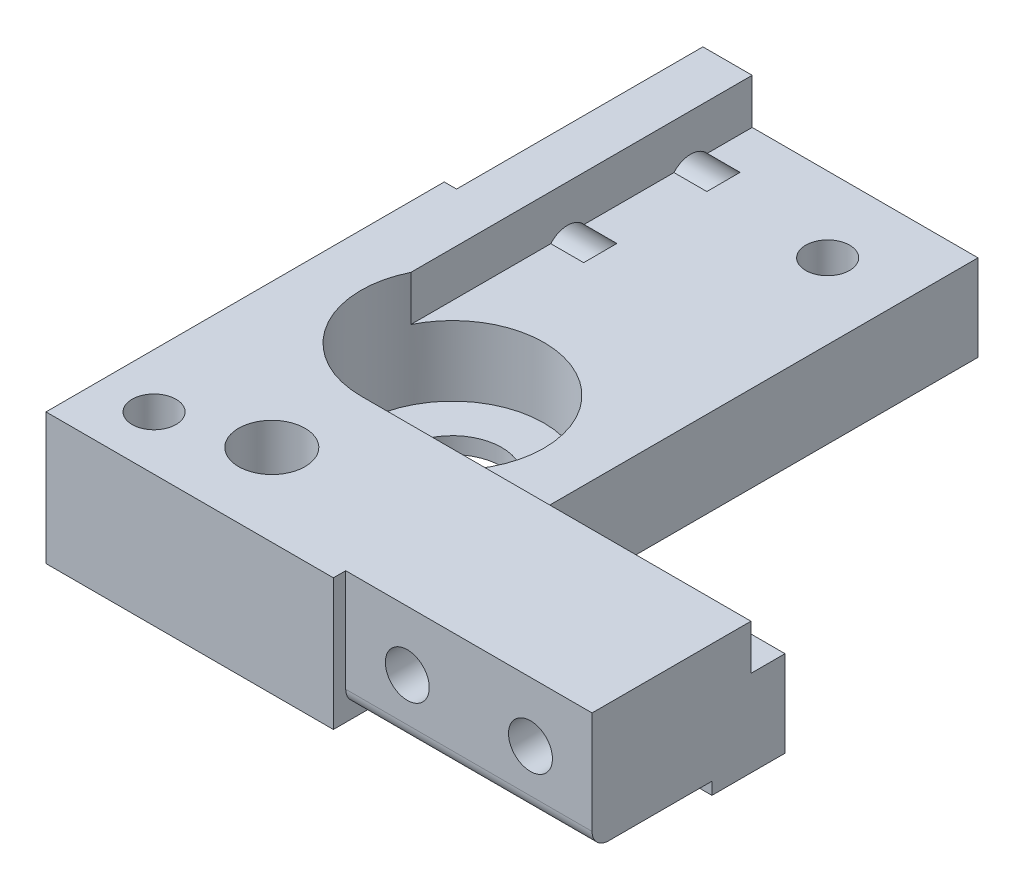
ISO-10303-21;
HEADER;
FILE_DESCRIPTION(('STEP AP214'),'2;1');
FILE_NAME('part.step','',(''),(''),'','','');
FILE_SCHEMA(('AUTOMOTIVE_DESIGN { 1 0 10303 214 1 1 1 1 }'));
ENDSEC;
DATA;
#1=APPLICATION_CONTEXT('core data for automotive mechanical design processes');
#2=APPLICATION_PROTOCOL_DEFINITION('international standard','automotive_design',2000,#1);
#3=PRODUCT_CONTEXT('',#1,'mechanical');
#4=PRODUCT('Part','Part','',(#3));
#5=PRODUCT_RELATED_PRODUCT_CATEGORY('part','',(#4));
#6=PRODUCT_DEFINITION_FORMATION('','',#4);
#7=PRODUCT_DEFINITION_CONTEXT('part definition',#1,'design');
#8=PRODUCT_DEFINITION('design','',#6,#7);
#9=PRODUCT_DEFINITION_SHAPE('','',#8);
#10=(LENGTH_UNIT() NAMED_UNIT(*) SI_UNIT(.MILLI.,.METRE.));
#11=(NAMED_UNIT(*) PLANE_ANGLE_UNIT() SI_UNIT($,.RADIAN.));
#12=(NAMED_UNIT(*) SI_UNIT($,.STERADIAN.) SOLID_ANGLE_UNIT());
#13=UNCERTAINTY_MEASURE_WITH_UNIT(LENGTH_MEASURE(1.E-05),#10,'distance_accuracy_value','');
#14=(GEOMETRIC_REPRESENTATION_CONTEXT(3) GLOBAL_UNCERTAINTY_ASSIGNED_CONTEXT((#13)) GLOBAL_UNIT_ASSIGNED_CONTEXT((#10,
#11,#12)) REPRESENTATION_CONTEXT('',''));
#15=CARTESIAN_POINT('',(0.,0.,0.));
#16=DIRECTION('',(0.,0.,1.));
#17=DIRECTION('',(1.,0.,0.));
#18=AXIS2_PLACEMENT_3D('',#15,#16,#17);
#19=CARTESIAN_POINT('',(35.,16.,-78.5));
#20=DIRECTION('',(-1.,0.,0.));
#21=DIRECTION('',(0.,0.,-1.));
#22=AXIS2_PLACEMENT_3D('',#19,#20,#21);
#23=PLANE('',#22);
#24=DIRECTION('',(0.,0.,1.));
#25=VECTOR('',#24,1.);
#26=CARTESIAN_POINT('',(35.,10.5,-78.5));
#27=LINE('',#26,#25);
#28=CARTESIAN_POINT('',(35.,10.5,-78.5));
#29=VERTEX_POINT('',#28);
#30=CARTESIAN_POINT('',(35.,10.5,-25.));
#31=VERTEX_POINT('',#30);
#32=EDGE_CURVE('E202',#29,#31,#27,.T.);
#33=ORIENTED_EDGE('',*,*,#32,.T.);
#34=DIRECTION('',(0.,-1.,0.));
#35=VECTOR('',#34,1.);
#36=CARTESIAN_POINT('',(35.,16.,-25.));
#37=LINE('',#36,#35);
#38=CARTESIAN_POINT('',(35.,0.,-25.));
#39=VERTEX_POINT('',#38);
#40=EDGE_CURVE('E210',#31,#39,#37,.T.);
#41=ORIENTED_EDGE('',*,*,#40,.T.);
#42=DIRECTION('',(0.,0.,1.));
#43=VECTOR('',#42,1.);
#44=CARTESIAN_POINT('',(35.,0.,-78.5));
#45=LINE('',#44,#43);
#46=CARTESIAN_POINT('',(35.,0.,-78.5));
#47=VERTEX_POINT('',#46);
#48=EDGE_CURVE('E396',#47,#39,#45,.T.);
#49=ORIENTED_EDGE('',*,*,#48,.F.);
#50=DIRECTION('',(0.,-1.,0.));
#51=VECTOR('',#50,1.);
#52=CARTESIAN_POINT('',(35.,16.,-78.5));
#53=LINE('',#52,#51);
#54=EDGE_CURVE('E217',#29,#47,#53,.T.);
#55=ORIENTED_EDGE('',*,*,#54,.F.);
#56=EDGE_LOOP('',(#33,#41,#49,#55));
#57=FACE_BOUND('',#56,.T.);
#58=ADVANCED_FACE('F35',(#57),#23,.F.);
#59=CARTESIAN_POINT('',(35.,16.,-25.));
#60=DIRECTION('',(0.,0.,1.));
#61=DIRECTION('',(-1.,0.,0.));
#62=AXIS2_PLACEMENT_3D('',#59,#60,#61);
#63=PLANE('',#62);
#64=DIRECTION('',(1.,0.,0.));
#65=VECTOR('',#64,1.);
#66=CARTESIAN_POINT('',(65.,10.5,-25.));
#67=LINE('',#66,#65);
#68=CARTESIAN_POINT('',(65.,10.5,-25.));
#69=VERTEX_POINT('',#68);
#70=EDGE_CURVE('E196',#31,#69,#67,.T.);
#71=ORIENTED_EDGE('',*,*,#70,.T.);
#72=DIRECTION('',(0.,-1.,0.));
#73=VECTOR('',#72,1.);
#74=CARTESIAN_POINT('',(65.,16.,-25.));
#75=LINE('',#74,#73);
#76=CARTESIAN_POINT('',(65.,0.,-25.));
#77=VERTEX_POINT('',#76);
#78=EDGE_CURVE('E218',#69,#77,#75,.T.);
#79=ORIENTED_EDGE('',*,*,#78,.T.);
#80=DIRECTION('',(1.,0.,0.));
#81=VECTOR('',#80,1.);
#82=CARTESIAN_POINT('',(35.,0.,-25.));
#83=LINE('',#82,#81);
#84=EDGE_CURVE('E213',#39,#77,#83,.T.);
#85=ORIENTED_EDGE('',*,*,#84,.F.);
#86=ORIENTED_EDGE('',*,*,#40,.F.);
#87=EDGE_LOOP('',(#71,#79,#85,#86));
#88=FACE_BOUND('',#87,.T.);
#89=ADVANCED_FACE('F211',(#88),#63,.F.);
#90=CARTESIAN_POINT('',(11.5,8.75,-56.));
#91=DIRECTION('',(-1.,0.,0.));
#92=DIRECTION('',(0.,-1.,0.));
#93=AXIS2_PLACEMENT_3D('',#90,#91,#92);
#94=CYLINDRICAL_SURFACE('',#93,2.675);
#95=CARTESIAN_POINT('',(1.5,8.75,-56.));
#96=DIRECTION('',(1.,0.,0.));
#97=DIRECTION('',(0.,-1.,0.));
#98=AXIS2_PLACEMENT_3D('',#95,#96,#97);
#99=CIRCLE('',#98,2.675);
#100=CARTESIAN_POINT('',(1.5,6.075,-56.));
#101=VERTEX_POINT('',#100);
#102=EDGE_CURVE('E285',#101,#101,#99,.T.);
#103=ORIENTED_EDGE('',*,*,#102,.F.);
#104=EDGE_LOOP('',(#103));
#105=FACE_BOUND('',#104,.T.);
#106=DIRECTION('',(-1.,0.,0.));
#107=VECTOR('',#106,1.);
#108=CARTESIAN_POINT('',(11.5,10.5,-53.9768526993815));
#109=LINE('',#108,#107);
#110=CARTESIAN_POINT('',(7.50000000000001,10.5,-53.9768526993815));
#111=VERTEX_POINT('',#110);
#112=CARTESIAN_POINT('',(11.5,10.5,-53.9768526993815));
#113=VERTEX_POINT('',#112);
#114=EDGE_CURVE('E260',#111,#113,#109,.F.);
#115=ORIENTED_EDGE('',*,*,#114,.T.);
#116=CARTESIAN_POINT('',(11.5,8.75,-56.));
#117=DIRECTION('',(1.,0.,0.));
#118=DIRECTION('',(0.,-1.,0.));
#119=AXIS2_PLACEMENT_3D('',#116,#117,#118);
#120=CIRCLE('',#119,2.675);
#121=CARTESIAN_POINT('',(11.5,10.5,-58.0231473006185));
#122=VERTEX_POINT('',#121);
#123=EDGE_CURVE('E288',#113,#122,#120,.T.);
#124=ORIENTED_EDGE('',*,*,#123,.T.);
#125=DIRECTION('',(-1.,0.,0.));
#126=VECTOR('',#125,1.);
#127=CARTESIAN_POINT('',(11.5,10.5,-58.0231473006185));
#128=LINE('',#127,#126);
#129=CARTESIAN_POINT('',(7.50000000000001,10.5,-58.0231473006185));
#130=VERTEX_POINT('',#129);
#131=EDGE_CURVE('E257',#122,#130,#128,.T.);
#132=ORIENTED_EDGE('',*,*,#131,.T.);
#133=CARTESIAN_POINT('',(7.50000000000001,8.75,-56.));
#134=DIRECTION('',(1.,0.,0.));
#135=DIRECTION('',(0.,0.,-1.));
#136=AXIS2_PLACEMENT_3D('',#133,#134,#135);
#137=CIRCLE('',#136,2.675);
#138=EDGE_CURVE('E266',#111,#130,#137,.F.);
#139=ORIENTED_EDGE('',*,*,#138,.F.);
#140=EDGE_LOOP('',(#115,#124,#132,#139));
#141=FACE_BOUND('',#140,.T.);
#142=ADVANCED_FACE('F507',(#105,#141),#94,.F.);
#143=CARTESIAN_POINT('',(11.5,8.75,-56.));
#144=DIRECTION('',(-1.,0.,0.));
#145=DIRECTION('',(0.,-1.,0.));
#146=AXIS2_PLACEMENT_3D('',#143,#144,#145);
#147=PLANE('',#146);
#148=ORIENTED_EDGE('',*,*,#123,.F.);
#149=DIRECTION('',(0.,0.,1.));
#150=VECTOR('',#149,1.);
#151=CARTESIAN_POINT('',(11.5,10.5,-56.));
#152=LINE('',#151,#150);
#153=EDGE_CURVE('E255',#122,#113,#152,.T.);
#154=ORIENTED_EDGE('',*,*,#153,.F.);
#155=EDGE_LOOP('',(#148,#154));
#156=FACE_BOUND('',#155,.T.);
#157=ADVANCED_FACE('F510',(#156),#147,.T.);
#158=CARTESIAN_POINT('',(11.5,8.75,-71.));
#159=DIRECTION('',(-1.,0.,0.));
#160=DIRECTION('',(0.,-1.,0.));
#161=AXIS2_PLACEMENT_3D('',#158,#159,#160);
#162=CYLINDRICAL_SURFACE('',#161,2.675);
#163=CARTESIAN_POINT('',(1.5,8.75,-71.));
#164=DIRECTION('',(1.,0.,0.));
#165=DIRECTION('',(0.,-1.,0.));
#166=AXIS2_PLACEMENT_3D('',#163,#164,#165);
#167=CIRCLE('',#166,2.675);
#168=CARTESIAN_POINT('',(1.5,6.075,-71.));
#169=VERTEX_POINT('',#168);
#170=EDGE_CURVE('E279',#169,#169,#167,.T.);
#171=ORIENTED_EDGE('',*,*,#170,.F.);
#172=EDGE_LOOP('',(#171));
#173=FACE_BOUND('',#172,.T.);
#174=DIRECTION('',(-1.,0.,0.));
#175=VECTOR('',#174,1.);
#176=CARTESIAN_POINT('',(11.5,10.5,-68.9768526993815));
#177=LINE('',#176,#175);
#178=CARTESIAN_POINT('',(7.50000000000001,10.5,-68.9768526993815));
#179=VERTEX_POINT('',#178);
#180=CARTESIAN_POINT('',(11.5,10.5,-68.9768526993815));
#181=VERTEX_POINT('',#180);
#182=EDGE_CURVE('E252',#179,#181,#177,.F.);
#183=ORIENTED_EDGE('',*,*,#182,.T.);
#184=CARTESIAN_POINT('',(11.5,8.75,-71.));
#185=DIRECTION('',(1.,0.,0.));
#186=DIRECTION('',(0.,-1.,0.));
#187=AXIS2_PLACEMENT_3D('',#184,#185,#186);
#188=CIRCLE('',#187,2.675);
#189=CARTESIAN_POINT('',(11.5,10.5,-73.0231473006185));
#190=VERTEX_POINT('',#189);
#191=EDGE_CURVE('E282',#181,#190,#188,.T.);
#192=ORIENTED_EDGE('',*,*,#191,.T.);
#193=DIRECTION('',(-1.,0.,0.));
#194=VECTOR('',#193,1.);
#195=CARTESIAN_POINT('',(11.5,10.5,-73.0231473006185));
#196=LINE('',#195,#194);
#197=CARTESIAN_POINT('',(7.50000000000001,10.5,-73.0231473006185));
#198=VERTEX_POINT('',#197);
#199=EDGE_CURVE('E249',#190,#198,#196,.T.);
#200=ORIENTED_EDGE('',*,*,#199,.T.);
#201=CARTESIAN_POINT('',(7.50000000000001,8.75,-71.));
#202=DIRECTION('',(1.,0.,0.));
#203=DIRECTION('',(0.,0.,-1.));
#204=AXIS2_PLACEMENT_3D('',#201,#202,#203);
#205=CIRCLE('',#204,2.675);
#206=EDGE_CURVE('E412',#179,#198,#205,.F.);
#207=ORIENTED_EDGE('',*,*,#206,.F.);
#208=EDGE_LOOP('',(#183,#192,#200,#207));
#209=FACE_BOUND('',#208,.T.);
#210=ADVANCED_FACE('F499',(#173,#209),#162,.F.);
#211=CARTESIAN_POINT('',(11.5,8.75,-71.));
#212=DIRECTION('',(-1.,0.,0.));
#213=DIRECTION('',(0.,-1.,0.));
#214=AXIS2_PLACEMENT_3D('',#211,#212,#213);
#215=PLANE('',#214);
#216=ORIENTED_EDGE('',*,*,#191,.F.);
#217=DIRECTION('',(0.,0.,1.));
#218=VECTOR('',#217,1.);
#219=CARTESIAN_POINT('',(11.5,10.5,-71.));
#220=LINE('',#219,#218);
#221=EDGE_CURVE('E247',#190,#181,#220,.T.);
#222=ORIENTED_EDGE('',*,*,#221,.F.);
#223=EDGE_LOOP('',(#216,#222));
#224=FACE_BOUND('',#223,.T.);
#225=ADVANCED_FACE('F502',(#224),#215,.T.);
#226=CARTESIAN_POINT('',(25.8455481504227,0.,-69.3455481504227));
#227=DIRECTION('',(0.,1.,0.));
#228=DIRECTION('',(0.,0.,-1.));
#229=AXIS2_PLACEMENT_3D('',#226,#227,#228);
#230=CYLINDRICAL_SURFACE('',#229,2.675);
#231=CARTESIAN_POINT('',(25.8455481504227,0.,-69.3455481504227));
#232=DIRECTION('',(0.,-1.,0.));
#233=DIRECTION('',(0.,0.,-1.));
#234=AXIS2_PLACEMENT_3D('',#231,#232,#233);
#235=CIRCLE('',#234,2.675);
#236=CARTESIAN_POINT('',(25.8455481504227,0.,-72.0205481504227));
#237=VERTEX_POINT('',#236);
#238=EDGE_CURVE('E272',#237,#237,#235,.T.);
#239=ORIENTED_EDGE('',*,*,#238,.T.);
#240=EDGE_LOOP('',(#239));
#241=FACE_BOUND('',#240,.T.);
#242=CARTESIAN_POINT('',(25.8455481504227,10.5,-69.3455481504227));
#243=DIRECTION('',(0.,-1.,0.));
#244=DIRECTION('',(0.,0.,-1.));
#245=AXIS2_PLACEMENT_3D('',#242,#243,#244);
#246=CIRCLE('',#245,2.675);
#247=CARTESIAN_POINT('',(25.8455481504227,10.5,-72.0205481504227));
#248=VERTEX_POINT('',#247);
#249=EDGE_CURVE('E242',#248,#248,#246,.F.);
#250=ORIENTED_EDGE('',*,*,#249,.T.);
#251=EDGE_LOOP('',(#250));
#252=FACE_BOUND('',#251,.T.);
#253=ADVANCED_FACE('F539',(#241,#252),#230,.F.);
#254=CARTESIAN_POINT('',(0.,16.,0.));
#255=DIRECTION('',(1.,0.,0.));
#256=DIRECTION('',(0.,0.,1.));
#257=AXIS2_PLACEMENT_3D('',#254,#255,#256);
#258=PLANE('',#257);
#259=DIRECTION('',(0.,0.,-1.));
#260=VECTOR('',#259,1.);
#261=CARTESIAN_POINT('',(0.,0.,0.));
#262=LINE('',#261,#260);
#263=CARTESIAN_POINT('',(0.,0.,0.));
#264=VERTEX_POINT('',#263);
#265=CARTESIAN_POINT('',(0.,0.,-48.5));
#266=VERTEX_POINT('',#265);
#267=EDGE_CURVE('E376',#264,#266,#262,.T.);
#268=ORIENTED_EDGE('',*,*,#267,.F.);
#269=DIRECTION('',(0.,-1.,0.));
#270=VECTOR('',#269,1.);
#271=CARTESIAN_POINT('',(0.,16.,0.));
#272=LINE('',#271,#270);
#273=CARTESIAN_POINT('',(0.,16.,0.));
#274=VERTEX_POINT('',#273);
#275=EDGE_CURVE('E391',#274,#264,#272,.T.);
#276=ORIENTED_EDGE('',*,*,#275,.F.);
#277=DIRECTION('',(0.,0.,-1.));
#278=VECTOR('',#277,1.);
#279=CARTESIAN_POINT('',(0.,16.,0.));
#280=LINE('',#279,#278);
#281=CARTESIAN_POINT('',(0.,16.,-48.5));
#282=VERTEX_POINT('',#281);
#283=EDGE_CURVE('E379',#274,#282,#280,.T.);
#284=ORIENTED_EDGE('',*,*,#283,.T.);
#285=DIRECTION('',(0.,-1.,0.));
#286=VECTOR('',#285,1.);
#287=CARTESIAN_POINT('',(0.,0.,-48.5));
#288=LINE('',#287,#286);
#289=EDGE_CURVE('E304',#282,#266,#288,.T.);
#290=ORIENTED_EDGE('',*,*,#289,.T.);
#291=EDGE_LOOP('',(#268,#276,#284,#290));
#292=FACE_BOUND('',#291,.T.);
#293=ADVANCED_FACE('F467',(#292),#258,.F.);
#294=CARTESIAN_POINT('',(0.,16.,-78.5));
#295=DIRECTION('',(0.,0.,1.));
#296=DIRECTION('',(-1.,0.,0.));
#297=AXIS2_PLACEMENT_3D('',#294,#295,#296);
#298=PLANE('',#297);
#299=DIRECTION('',(0.,1.,0.));
#300=VECTOR('',#299,1.);
#301=CARTESIAN_POINT('',(1.5,16.1,-78.5));
#302=LINE('',#301,#300);
#303=CARTESIAN_POINT('',(1.5,3.5,-78.5));
#304=VERTEX_POINT('',#303);
#305=CARTESIAN_POINT('',(1.5,16.,-78.5));
#306=VERTEX_POINT('',#305);
#307=EDGE_CURVE('E298',#304,#306,#302,.T.);
#308=ORIENTED_EDGE('',*,*,#307,.T.);
#309=DIRECTION('',(1.,0.,0.));
#310=VECTOR('',#309,1.);
#311=CARTESIAN_POINT('',(0.,16.,-78.5));
#312=LINE('',#311,#310);
#313=CARTESIAN_POINT('',(7.50000000000001,16.,-78.5));
#314=VERTEX_POINT('',#313);
#315=EDGE_CURVE('E382',#306,#314,#312,.T.);
#316=ORIENTED_EDGE('',*,*,#315,.T.);
#317=DIRECTION('',(0.,1.,0.));
#318=VECTOR('',#317,1.);
#319=CARTESIAN_POINT('',(7.50000000000001,10.5,-78.5));
#320=LINE('',#319,#318);
#321=CARTESIAN_POINT('',(7.50000000000001,10.5,-78.5));
#322=VERTEX_POINT('',#321);
#323=EDGE_CURVE('E239',#322,#314,#320,.T.);
#324=ORIENTED_EDGE('',*,*,#323,.F.);
#325=DIRECTION('',(1.,0.,0.));
#326=VECTOR('',#325,1.);
#327=CARTESIAN_POINT('',(35.,10.5,-78.5));
#328=LINE('',#327,#326);
#329=EDGE_CURVE('E234',#322,#29,#328,.T.);
#330=ORIENTED_EDGE('',*,*,#329,.T.);
#331=ORIENTED_EDGE('',*,*,#54,.T.);
#332=DIRECTION('',(1.,0.,0.));
#333=VECTOR('',#332,1.);
#334=CARTESIAN_POINT('',(0.,0.,-78.5));
#335=LINE('',#334,#333);
#336=CARTESIAN_POINT('',(16.1,0.,-78.5));
#337=VERTEX_POINT('',#336);
#338=EDGE_CURVE('E394',#337,#47,#335,.T.);
#339=ORIENTED_EDGE('',*,*,#338,.F.);
#340=DIRECTION('',(0.,1.,0.));
#341=VECTOR('',#340,1.);
#342=CARTESIAN_POINT('',(16.1,1.5,-78.5));
#343=LINE('',#342,#341);
#344=CARTESIAN_POINT('',(16.1,1.5,-78.5));
#345=VERTEX_POINT('',#344);
#346=EDGE_CURVE('E291',#337,#345,#343,.T.);
#347=ORIENTED_EDGE('',*,*,#346,.T.);
#348=DIRECTION('',(-1.,0.,0.));
#349=VECTOR('',#348,1.);
#350=CARTESIAN_POINT('',(1.5,1.5,-78.5));
#351=LINE('',#350,#349);
#352=CARTESIAN_POINT('',(3.5,1.5,-78.5));
#353=VERTEX_POINT('',#352);
#354=EDGE_CURVE('E310',#345,#353,#351,.T.);
#355=ORIENTED_EDGE('',*,*,#354,.T.);
#356=CARTESIAN_POINT('',(3.5,3.5,-78.5));
#357=DIRECTION('',(0.,0.,-1.));
#358=DIRECTION('',(-1.,0.,0.));
#359=AXIS2_PLACEMENT_3D('',#356,#357,#358);
#360=CIRCLE('',#359,2.);
#361=EDGE_CURVE('E427',#304,#353,#360,.F.);
#362=ORIENTED_EDGE('',*,*,#361,.F.);
#363=EDGE_LOOP('',(#308,#316,#324,#330,#331,#339,#347,#355,#362));
#364=FACE_BOUND('',#363,.T.);
#365=ADVANCED_FACE('F482',(#364),#298,.F.);
#366=CARTESIAN_POINT('',(65.,16.,0.));
#367=DIRECTION('',(-1.,0.,0.));
#368=DIRECTION('',(0.,0.,-1.));
#369=AXIS2_PLACEMENT_3D('',#366,#367,#368);
#370=PLANE('',#369);
#371=DIRECTION('',(0.,0.,-1.));
#372=VECTOR('',#371,1.);
#373=CARTESIAN_POINT('',(65.,1.5,-16.1));
#374=LINE('',#373,#372);
#375=CARTESIAN_POINT('',(65.,1.5,-3.49999999999999));
#376=VERTEX_POINT('',#375);
#377=CARTESIAN_POINT('',(65.,1.5,-16.1));
#378=VERTEX_POINT('',#377);
#379=EDGE_CURVE('E349',#376,#378,#374,.T.);
#380=ORIENTED_EDGE('',*,*,#379,.T.);
#381=DIRECTION('',(0.,-1.,0.));
#382=VECTOR('',#381,1.);
#383=CARTESIAN_POINT('',(65.,0.,-16.1));
#384=LINE('',#383,#382);
#385=CARTESIAN_POINT('',(65.,0.,-16.1));
#386=VERTEX_POINT('',#385);
#387=EDGE_CURVE('E336',#378,#386,#384,.T.);
#388=ORIENTED_EDGE('',*,*,#387,.T.);
#389=DIRECTION('',(0.,0.,1.));
#390=VECTOR('',#389,1.);
#391=CARTESIAN_POINT('',(65.,0.,0.));
#392=LINE('',#391,#390);
#393=EDGE_CURVE('E399',#77,#386,#392,.T.);
#394=ORIENTED_EDGE('',*,*,#393,.F.);
#395=ORIENTED_EDGE('',*,*,#78,.F.);
#396=DIRECTION('',(0.,0.,1.));
#397=VECTOR('',#396,1.);
#398=CARTESIAN_POINT('',(65.,10.5,-20.85));
#399=LINE('',#398,#397);
#400=CARTESIAN_POINT('',(65.,10.5,-20.85));
#401=VERTEX_POINT('',#400);
#402=EDGE_CURVE('E204',#69,#401,#399,.T.);
#403=ORIENTED_EDGE('',*,*,#402,.T.);
#404=DIRECTION('',(0.,1.,0.));
#405=VECTOR('',#404,1.);
#406=CARTESIAN_POINT('',(65.,10.5,-20.85));
#407=LINE('',#406,#405);
#408=CARTESIAN_POINT('',(65.,16.,-20.85));
#409=VERTEX_POINT('',#408);
#410=EDGE_CURVE('E236',#401,#409,#407,.T.);
#411=ORIENTED_EDGE('',*,*,#410,.T.);
#412=DIRECTION('',(0.,0.,1.));
#413=VECTOR('',#412,1.);
#414=CARTESIAN_POINT('',(65.,16.,0.));
#415=LINE('',#414,#413);
#416=CARTESIAN_POINT('',(65.,16.,-1.49999999999999));
#417=VERTEX_POINT('',#416);
#418=EDGE_CURVE('E386',#409,#417,#415,.T.);
#419=ORIENTED_EDGE('',*,*,#418,.T.);
#420=DIRECTION('',(0.,-1.,0.));
#421=VECTOR('',#420,1.);
#422=CARTESIAN_POINT('',(65.,1.5,-1.49999999999999));
#423=LINE('',#422,#421);
#424=CARTESIAN_POINT('',(65.,3.5,-1.49999999999999));
#425=VERTEX_POINT('',#424);
#426=EDGE_CURVE('E330',#417,#425,#423,.T.);
#427=ORIENTED_EDGE('',*,*,#426,.T.);
#428=CARTESIAN_POINT('',(65.,3.5,-3.49999999999999));
#429=DIRECTION('',(1.,0.,0.));
#430=DIRECTION('',(0.,0.,-1.));
#431=AXIS2_PLACEMENT_3D('',#428,#429,#430);
#432=CIRCLE('',#431,2.);
#433=EDGE_CURVE('E419',#376,#425,#432,.F.);
#434=ORIENTED_EDGE('',*,*,#433,.F.);
#435=EDGE_LOOP('',(#380,#388,#394,#395,#403,#411,#419,#427,#434));
#436=FACE_BOUND('',#435,.T.);
#437=ADVANCED_FACE('F448',(#436),#370,.F.);
#438=CARTESIAN_POINT('',(0.,16.,0.));
#439=DIRECTION('',(0.,0.,-1.));
#440=DIRECTION('',(1.,0.,0.));
#441=AXIS2_PLACEMENT_3D('',#438,#439,#440);
#442=PLANE('',#441);
#443=DIRECTION('',(-1.,0.,0.));
#444=VECTOR('',#443,1.);
#445=CARTESIAN_POINT('',(0.,16.,0.));
#446=LINE('',#445,#444);
#447=CARTESIAN_POINT('',(35.,16.,0.));
#448=VERTEX_POINT('',#447);
#449=EDGE_CURVE('E389',#448,#274,#446,.T.);
#450=ORIENTED_EDGE('',*,*,#449,.T.);
#451=ORIENTED_EDGE('',*,*,#275,.T.);
#452=DIRECTION('',(-1.,0.,0.));
#453=VECTOR('',#452,1.);
#454=CARTESIAN_POINT('',(0.,0.,0.));
#455=LINE('',#454,#453);
#456=CARTESIAN_POINT('',(35.,0.,0.));
#457=VERTEX_POINT('',#456);
#458=EDGE_CURVE('E383',#457,#264,#455,.T.);
#459=ORIENTED_EDGE('',*,*,#458,.F.);
#460=DIRECTION('',(0.,1.,0.));
#461=VECTOR('',#460,1.);
#462=CARTESIAN_POINT('',(35.,16.1,0.));
#463=LINE('',#462,#461);
#464=EDGE_CURVE('E335',#457,#448,#463,.T.);
#465=ORIENTED_EDGE('',*,*,#464,.T.);
#466=EDGE_LOOP('',(#450,#451,#459,#465));
#467=FACE_BOUND('',#466,.T.);
#468=ADVANCED_FACE('F458',(#467),#442,.F.);
#469=CARTESIAN_POINT('',(0.,16.,0.));
#470=DIRECTION('',(0.,1.,0.));
#471=DIRECTION('',(0.,0.,-1.));
#472=AXIS2_PLACEMENT_3D('',#469,#470,#471);
#473=PLANE('',#472);
#474=DIRECTION('',(0.,0.,-1.));
#475=VECTOR('',#474,1.);
#476=CARTESIAN_POINT('',(7.50000000000001,16.,-78.5));
#477=LINE('',#476,#475);
#478=CARTESIAN_POINT('',(7.50000000000001,16.,-36.9317846668321));
#479=VERTEX_POINT('',#478);
#480=EDGE_CURVE('E222',#479,#314,#477,.T.);
#481=ORIENTED_EDGE('',*,*,#480,.T.);
#482=ORIENTED_EDGE('',*,*,#315,.F.);
#483=DIRECTION('',(0.,0.,1.));
#484=VECTOR('',#483,1.);
#485=CARTESIAN_POINT('',(1.5,16.,0.));
#486=LINE('',#485,#484);
#487=CARTESIAN_POINT('',(1.5,16.,-48.5));
#488=VERTEX_POINT('',#487);
#489=EDGE_CURVE('E409',#306,#488,#486,.T.);
#490=ORIENTED_EDGE('',*,*,#489,.T.);
#491=DIRECTION('',(-1.,0.,0.));
#492=VECTOR('',#491,1.);
#493=CARTESIAN_POINT('',(0.,16.,-48.5));
#494=LINE('',#493,#492);
#495=EDGE_CURVE('E317',#488,#282,#494,.T.);
#496=ORIENTED_EDGE('',*,*,#495,.T.);
#497=ORIENTED_EDGE('',*,*,#283,.F.);
#498=ORIENTED_EDGE('',*,*,#449,.F.);
#499=DIRECTION('',(0.,0.,-1.));
#500=VECTOR('',#499,1.);
#501=CARTESIAN_POINT('',(35.,16.,0.));
#502=LINE('',#501,#500);
#503=CARTESIAN_POINT('',(35.,16.,-1.49999999999999));
#504=VERTEX_POINT('',#503);
#505=EDGE_CURVE('E356',#448,#504,#502,.T.);
#506=ORIENTED_EDGE('',*,*,#505,.T.);
#507=DIRECTION('',(1.,0.,0.));
#508=VECTOR('',#507,1.);
#509=CARTESIAN_POINT('',(0.,16.,-1.49999999999999));
#510=LINE('',#509,#508);
#511=EDGE_CURVE('E407',#504,#417,#510,.T.);
#512=ORIENTED_EDGE('',*,*,#511,.T.);
#513=ORIENTED_EDGE('',*,*,#418,.F.);
#514=DIRECTION('',(-1.,0.,0.));
#515=VECTOR('',#514,1.);
#516=CARTESIAN_POINT('',(17.5,16.,-20.85));
#517=LINE('',#516,#515);
#518=CARTESIAN_POINT('',(17.5,16.,-20.85));
#519=VERTEX_POINT('',#518);
#520=EDGE_CURVE('E224',#409,#519,#517,.T.);
#521=ORIENTED_EDGE('',*,*,#520,.T.);
#522=CARTESIAN_POINT('',(17.5,16.,-32.));
#523=DIRECTION('',(0.,-1.,0.));
#524=DIRECTION('',(0.,0.,-1.));
#525=AXIS2_PLACEMENT_3D('',#522,#523,#524);
#526=CIRCLE('',#525,11.15);
#527=EDGE_CURVE('E370',#519,#479,#526,.T.);
#528=ORIENTED_EDGE('',*,*,#527,.T.);
#529=EDGE_LOOP('',(#481,#482,#490,#496,#497,#498,#506,#512,#513,#521,#528));
#530=FACE_BOUND('',#529,.T.);
#531=CARTESIAN_POINT('',(6.58093689720364,16.,-6.58093689720363));
#532=DIRECTION('',(0.,-1.,0.));
#533=DIRECTION('',(0.,0.,-1.));
#534=AXIS2_PLACEMENT_3D('',#531,#532,#533);
#535=CIRCLE('',#534,2.675);
#536=CARTESIAN_POINT('',(6.58093689720364,16.,-9.25593689720364));
#537=VERTEX_POINT('',#536);
#538=EDGE_CURVE('E275',#537,#537,#535,.T.);
#539=ORIENTED_EDGE('',*,*,#538,.T.);
#540=EDGE_LOOP('',(#539));
#541=FACE_BOUND('',#540,.T.);
#542=CARTESIAN_POINT('',(17.5,16.,-10.));
#543=DIRECTION('',(0.,-1.,0.));
#544=DIRECTION('',(0.,0.,-1.));
#545=AXIS2_PLACEMENT_3D('',#542,#543,#544);
#546=CIRCLE('',#545,4.04999999999999);
#547=CARTESIAN_POINT('',(17.5,16.,-14.05));
#548=VERTEX_POINT('',#547);
#549=EDGE_CURVE('E360',#548,#548,#546,.T.);
#550=ORIENTED_EDGE('',*,*,#549,.T.);
#551=EDGE_LOOP('',(#550));
#552=FACE_BOUND('',#551,.T.);
#553=ADVANCED_FACE('F460',(#530,#541,#552),#473,.T.);
#554=CARTESIAN_POINT('',(0.,0.,0.));
#555=DIRECTION('',(0.,1.,0.));
#556=DIRECTION('',(0.,0.,-1.));
#557=AXIS2_PLACEMENT_3D('',#554,#555,#556);
#558=PLANE('',#557);
#559=ORIENTED_EDGE('',*,*,#238,.F.);
#560=EDGE_LOOP('',(#559));
#561=FACE_BOUND('',#560,.T.);
#562=CARTESIAN_POINT('',(6.58093689720364,0.,-6.58093689720363));
#563=DIRECTION('',(0.,-1.,0.));
#564=DIRECTION('',(0.,0.,-1.));
#565=AXIS2_PLACEMENT_3D('',#562,#563,#564);
#566=CIRCLE('',#565,2.675);
#567=CARTESIAN_POINT('',(6.58093689720364,0.,-9.25593689720364));
#568=VERTEX_POINT('',#567);
#569=EDGE_CURVE('E276',#568,#568,#566,.T.);
#570=ORIENTED_EDGE('',*,*,#569,.F.);
#571=EDGE_LOOP('',(#570));
#572=FACE_BOUND('',#571,.T.);
#573=CARTESIAN_POINT('',(17.5,0.,-10.));
#574=DIRECTION('',(0.,-1.,0.));
#575=DIRECTION('',(0.,0.,-1.));
#576=AXIS2_PLACEMENT_3D('',#573,#574,#575);
#577=CIRCLE('',#576,4.04999999999999);
#578=CARTESIAN_POINT('',(17.5,0.,-14.05));
#579=VERTEX_POINT('',#578);
#580=EDGE_CURVE('E361',#579,#579,#577,.T.);
#581=ORIENTED_EDGE('',*,*,#580,.F.);
#582=EDGE_LOOP('',(#581));
#583=FACE_BOUND('',#582,.T.);
#584=CARTESIAN_POINT('',(17.5,0.,-32.));
#585=DIRECTION('',(0.,-1.,0.));
#586=DIRECTION('',(0.,0.,-1.));
#587=AXIS2_PLACEMENT_3D('',#584,#585,#586);
#588=CIRCLE('',#587,6.);
#589=CARTESIAN_POINT('',(17.5,0.,-38.));
#590=VERTEX_POINT('',#589);
#591=EDGE_CURVE('E367',#590,#590,#588,.T.);
#592=ORIENTED_EDGE('',*,*,#591,.F.);
#593=EDGE_LOOP('',(#592));
#594=FACE_BOUND('',#593,.T.);
#595=ORIENTED_EDGE('',*,*,#338,.T.);
#596=ORIENTED_EDGE('',*,*,#48,.T.);
#597=ORIENTED_EDGE('',*,*,#84,.T.);
#598=ORIENTED_EDGE('',*,*,#393,.T.);
#599=DIRECTION('',(1.,0.,0.));
#600=VECTOR('',#599,1.);
#601=CARTESIAN_POINT('',(35.,0.,-16.1));
#602=LINE('',#601,#600);
#603=CARTESIAN_POINT('',(35.,0.,-16.1));
#604=VERTEX_POINT('',#603);
#605=EDGE_CURVE('E354',#604,#386,#602,.T.);
#606=ORIENTED_EDGE('',*,*,#605,.F.);
#607=DIRECTION('',(0.,0.,1.));
#608=VECTOR('',#607,1.);
#609=CARTESIAN_POINT('',(35.,0.,0.));
#610=LINE('',#609,#608);
#611=EDGE_CURVE('E333',#604,#457,#610,.T.);
#612=ORIENTED_EDGE('',*,*,#611,.T.);
#613=ORIENTED_EDGE('',*,*,#458,.T.);
#614=ORIENTED_EDGE('',*,*,#267,.T.);
#615=DIRECTION('',(1.,0.,0.));
#616=VECTOR('',#615,1.);
#617=CARTESIAN_POINT('',(16.1,0.,-48.5));
#618=LINE('',#617,#616);
#619=CARTESIAN_POINT('',(16.1,0.,-48.5));
#620=VERTEX_POINT('',#619);
#621=EDGE_CURVE('E294',#266,#620,#618,.T.);
#622=ORIENTED_EDGE('',*,*,#621,.T.);
#623=DIRECTION('',(0.,0.,-1.));
#624=VECTOR('',#623,1.);
#625=CARTESIAN_POINT('',(16.1,0.,-48.5));
#626=LINE('',#625,#624);
#627=EDGE_CURVE('E307',#620,#337,#626,.T.);
#628=ORIENTED_EDGE('',*,*,#627,.T.);
#629=EDGE_LOOP('',(#595,#596,#597,#598,#606,#612,#613,#614,#622,#628));
#630=FACE_BOUND('',#629,.T.);
#631=ADVANCED_FACE('F469',(#561,#572,#583,#594,#630),#558,.F.);
#632=CARTESIAN_POINT('',(17.5,2.,-32.));
#633=DIRECTION('',(0.,1.,0.));
#634=DIRECTION('',(0.,0.,-1.));
#635=AXIS2_PLACEMENT_3D('',#632,#633,#634);
#636=CYLINDRICAL_SURFACE('',#635,11.15);
#637=ORIENTED_EDGE('',*,*,#527,.F.);
#638=DIRECTION('',(0.,1.,0.));
#639=VECTOR('',#638,1.);
#640=CARTESIAN_POINT('',(17.5,10.5,-20.85));
#641=LINE('',#640,#639);
#642=CARTESIAN_POINT('',(17.5,10.5,-20.85));
#643=VERTEX_POINT('',#642);
#644=EDGE_CURVE('E243',#643,#519,#641,.T.);
#645=ORIENTED_EDGE('',*,*,#644,.F.);
#646=CARTESIAN_POINT('',(17.5,10.5,-32.));
#647=DIRECTION('',(0.,-1.,0.));
#648=DIRECTION('',(0.,0.,-1.));
#649=AXIS2_PLACEMENT_3D('',#646,#647,#648);
#650=CIRCLE('',#649,11.15);
#651=CARTESIAN_POINT('',(7.50000000000001,10.5,-36.9317846668321));
#652=VERTEX_POINT('',#651);
#653=EDGE_CURVE('E263',#643,#652,#650,.F.);
#654=ORIENTED_EDGE('',*,*,#653,.T.);
#655=DIRECTION('',(0.,1.,0.));
#656=VECTOR('',#655,1.);
#657=CARTESIAN_POINT('',(7.50000000000001,2.,-36.9317846668321));
#658=LINE('',#657,#656);
#659=EDGE_CURVE('E269',#479,#652,#658,.F.);
#660=ORIENTED_EDGE('',*,*,#659,.F.);
#661=EDGE_LOOP('',(#637,#645,#654,#660));
#662=FACE_BOUND('',#661,.T.);
#663=CARTESIAN_POINT('',(17.5,2.,-32.));
#664=DIRECTION('',(0.,-1.,0.));
#665=DIRECTION('',(0.,0.,-1.));
#666=AXIS2_PLACEMENT_3D('',#663,#664,#665);
#667=CIRCLE('',#666,11.15);
#668=CARTESIAN_POINT('',(17.5,2.,-43.15));
#669=VERTEX_POINT('',#668);
#670=EDGE_CURVE('E373',#669,#669,#667,.T.);
#671=ORIENTED_EDGE('',*,*,#670,.T.);
#672=EDGE_LOOP('',(#671));
#673=FACE_BOUND('',#672,.T.);
#674=ADVANCED_FACE('F511',(#662,#673),#636,.F.);
#675=CARTESIAN_POINT('',(17.5,2.,-32.));
#676=DIRECTION('',(0.,1.,0.));
#677=DIRECTION('',(0.,0.,-1.));
#678=AXIS2_PLACEMENT_3D('',#675,#676,#677);
#679=PLANE('',#678);
#680=CARTESIAN_POINT('',(17.5,2.,-32.));
#681=DIRECTION('',(0.,-1.,0.));
#682=DIRECTION('',(0.,0.,-1.));
#683=AXIS2_PLACEMENT_3D('',#680,#681,#682);
#684=CIRCLE('',#683,6.);
#685=CARTESIAN_POINT('',(17.5,2.,-38.));
#686=VERTEX_POINT('',#685);
#687=EDGE_CURVE('E364',#686,#686,#684,.T.);
#688=ORIENTED_EDGE('',*,*,#687,.T.);
#689=EDGE_LOOP('',(#688));
#690=FACE_BOUND('',#689,.T.);
#691=ORIENTED_EDGE('',*,*,#670,.F.);
#692=EDGE_LOOP('',(#691));
#693=FACE_BOUND('',#692,.T.);
#694=ADVANCED_FACE('F514',(#690,#693),#679,.T.);
#695=CARTESIAN_POINT('',(17.5,0.,-32.));
#696=DIRECTION('',(0.,1.,0.));
#697=DIRECTION('',(0.,0.,-1.));
#698=AXIS2_PLACEMENT_3D('',#695,#696,#697);
#699=CYLINDRICAL_SURFACE('',#698,6.);
#700=ORIENTED_EDGE('',*,*,#591,.T.);
#701=EDGE_LOOP('',(#700));
#702=FACE_BOUND('',#701,.T.);
#703=ORIENTED_EDGE('',*,*,#687,.F.);
#704=EDGE_LOOP('',(#703));
#705=FACE_BOUND('',#704,.T.);
#706=ADVANCED_FACE('F519',(#702,#705),#699,.F.);
#707=CARTESIAN_POINT('',(17.5,0.,-10.));
#708=DIRECTION('',(0.,1.,0.));
#709=DIRECTION('',(0.,0.,-1.));
#710=AXIS2_PLACEMENT_3D('',#707,#708,#709);
#711=CYLINDRICAL_SURFACE('',#710,4.04999999999999);
#712=ORIENTED_EDGE('',*,*,#580,.T.);
#713=EDGE_LOOP('',(#712));
#714=FACE_BOUND('',#713,.T.);
#715=ORIENTED_EDGE('',*,*,#549,.F.);
#716=EDGE_LOOP('',(#715));
#717=FACE_BOUND('',#716,.T.);
#718=ADVANCED_FACE('F525',(#714,#717),#711,.F.);
#719=CARTESIAN_POINT('',(35.,0.,-16.1));
#720=DIRECTION('',(0.,0.,-1.));
#721=DIRECTION('',(1.,0.,0.));
#722=AXIS2_PLACEMENT_3D('',#719,#720,#721);
#723=PLANE('',#722);
#724=ORIENTED_EDGE('',*,*,#387,.F.);
#725=DIRECTION('',(1.,0.,0.));
#726=VECTOR('',#725,1.);
#727=CARTESIAN_POINT('',(35.,1.5,-16.1));
#728=LINE('',#727,#726);
#729=CARTESIAN_POINT('',(35.,1.5,-16.1));
#730=VERTEX_POINT('',#729);
#731=EDGE_CURVE('E346',#730,#378,#728,.T.);
#732=ORIENTED_EDGE('',*,*,#731,.F.);
#733=DIRECTION('',(0.,-1.,0.));
#734=VECTOR('',#733,1.);
#735=CARTESIAN_POINT('',(35.,0.,-16.1));
#736=LINE('',#735,#734);
#737=EDGE_CURVE('E344',#730,#604,#736,.T.);
#738=ORIENTED_EDGE('',*,*,#737,.T.);
#739=ORIENTED_EDGE('',*,*,#605,.T.);
#740=EDGE_LOOP('',(#724,#732,#738,#739));
#741=FACE_BOUND('',#740,.T.);
#742=ADVANCED_FACE('F446',(#741),#723,.F.);
#743=CARTESIAN_POINT('',(35.,1.5,-16.1));
#744=DIRECTION('',(0.,1.,0.));
#745=DIRECTION('',(0.,0.,-1.));
#746=AXIS2_PLACEMENT_3D('',#743,#744,#745);
#747=PLANE('',#746);
#748=DIRECTION('',(0.,0.,-1.));
#749=VECTOR('',#748,1.);
#750=CARTESIAN_POINT('',(35.,1.5,-16.1));
#751=LINE('',#750,#749);
#752=CARTESIAN_POINT('',(35.,1.5,-3.49999999999999));
#753=VERTEX_POINT('',#752);
#754=EDGE_CURVE('E342',#753,#730,#751,.T.);
#755=ORIENTED_EDGE('',*,*,#754,.T.);
#756=ORIENTED_EDGE('',*,*,#731,.T.);
#757=ORIENTED_EDGE('',*,*,#379,.F.);
#758=DIRECTION('',(1.,0.,0.));
#759=VECTOR('',#758,1.);
#760=CARTESIAN_POINT('',(35.,1.5,-3.49999999999999));
#761=LINE('',#760,#759);
#762=EDGE_CURVE('E417',#753,#376,#761,.T.);
#763=ORIENTED_EDGE('',*,*,#762,.F.);
#764=EDGE_LOOP('',(#755,#756,#757,#763));
#765=FACE_BOUND('',#764,.T.);
#766=ADVANCED_FACE('F437',(#765),#747,.F.);
#767=CARTESIAN_POINT('',(35.,1.5,-1.49999999999999));
#768=DIRECTION('',(0.,0.,-1.));
#769=DIRECTION('',(1.,0.,0.));
#770=AXIS2_PLACEMENT_3D('',#767,#768,#769);
#771=PLANE('',#770);
#772=CARTESIAN_POINT('',(57.5,8.75,-1.49999999999999));
#773=DIRECTION('',(0.,0.,-1.));
#774=DIRECTION('',(-1.,0.,0.));
#775=AXIS2_PLACEMENT_3D('',#772,#773,#774);
#776=CIRCLE('',#775,2.675);
#777=CARTESIAN_POINT('',(54.825,8.75,-1.49999999999999));
#778=VERTEX_POINT('',#777);
#779=EDGE_CURVE('E320',#778,#778,#776,.T.);
#780=ORIENTED_EDGE('',*,*,#779,.T.);
#781=EDGE_LOOP('',(#780));
#782=FACE_BOUND('',#781,.T.);
#783=CARTESIAN_POINT('',(42.5,8.75,-1.49999999999999));
#784=DIRECTION('',(0.,0.,-1.));
#785=DIRECTION('',(-1.,0.,0.));
#786=AXIS2_PLACEMENT_3D('',#783,#784,#785);
#787=CIRCLE('',#786,2.675);
#788=CARTESIAN_POINT('',(39.825,8.75,-1.49999999999999));
#789=VERTEX_POINT('',#788);
#790=EDGE_CURVE('E324',#789,#789,#787,.T.);
#791=ORIENTED_EDGE('',*,*,#790,.T.);
#792=EDGE_LOOP('',(#791));
#793=FACE_BOUND('',#792,.T.);
#794=ORIENTED_EDGE('',*,*,#426,.F.);
#795=ORIENTED_EDGE('',*,*,#511,.F.);
#796=DIRECTION('',(0.,-1.,0.));
#797=VECTOR('',#796,1.);
#798=CARTESIAN_POINT('',(35.,1.5,-1.49999999999999));
#799=LINE('',#798,#797);
#800=CARTESIAN_POINT('',(35.,3.5,-1.49999999999999));
#801=VERTEX_POINT('',#800);
#802=EDGE_CURVE('E339',#504,#801,#799,.T.);
#803=ORIENTED_EDGE('',*,*,#802,.T.);
#804=DIRECTION('',(1.,0.,0.));
#805=VECTOR('',#804,1.);
#806=CARTESIAN_POINT('',(35.,3.5,-1.49999999999999));
#807=LINE('',#806,#805);
#808=EDGE_CURVE('E422',#425,#801,#807,.F.);
#809=ORIENTED_EDGE('',*,*,#808,.F.);
#810=EDGE_LOOP('',(#794,#795,#803,#809));
#811=FACE_BOUND('',#810,.T.);
#812=ADVANCED_FACE('F453',(#782,#793,#811),#771,.F.);
#813=CARTESIAN_POINT('',(35.,0.,0.));
#814=DIRECTION('',(-1.,0.,0.));
#815=DIRECTION('',(0.,0.,-1.));
#816=AXIS2_PLACEMENT_3D('',#813,#814,#815);
#817=PLANE('',#816);
#818=ORIENTED_EDGE('',*,*,#505,.F.);
#819=ORIENTED_EDGE('',*,*,#464,.F.);
#820=ORIENTED_EDGE('',*,*,#611,.F.);
#821=ORIENTED_EDGE('',*,*,#737,.F.);
#822=ORIENTED_EDGE('',*,*,#754,.F.);
#823=CARTESIAN_POINT('',(35.,3.5,-3.49999999999999));
#824=DIRECTION('',(1.,0.,0.));
#825=DIRECTION('',(0.,0.,-1.));
#826=AXIS2_PLACEMENT_3D('',#823,#824,#825);
#827=CIRCLE('',#826,2.);
#828=EDGE_CURVE('E43',#801,#753,#827,.T.);
#829=ORIENTED_EDGE('',*,*,#828,.F.);
#830=ORIENTED_EDGE('',*,*,#802,.F.);
#831=EDGE_LOOP('',(#818,#819,#820,#821,#822,#829,#830));
#832=FACE_BOUND('',#831,.T.);
#833=ADVANCED_FACE('F439',(#832),#817,.F.);
#834=CARTESIAN_POINT('',(42.5,8.75,-16.5));
#835=DIRECTION('',(0.,0.,1.));
#836=DIRECTION('',(-1.,0.,0.));
#837=AXIS2_PLACEMENT_3D('',#834,#835,#836);
#838=CYLINDRICAL_SURFACE('',#837,2.675);
#839=CARTESIAN_POINT('',(42.5,8.75,-16.5));
#840=DIRECTION('',(0.,0.,-1.));
#841=DIRECTION('',(-1.,0.,0.));
#842=AXIS2_PLACEMENT_3D('',#839,#840,#841);
#843=CIRCLE('',#842,2.675);
#844=CARTESIAN_POINT('',(39.825,8.75,-16.5));
#845=VERTEX_POINT('',#844);
#846=EDGE_CURVE('E327',#845,#845,#843,.T.);
#847=ORIENTED_EDGE('',*,*,#846,.T.);
#848=EDGE_LOOP('',(#847));
#849=FACE_BOUND('',#848,.T.);
#850=ORIENTED_EDGE('',*,*,#790,.F.);
#851=EDGE_LOOP('',(#850));
#852=FACE_BOUND('',#851,.T.);
#853=ADVANCED_FACE('F592',(#849,#852),#838,.F.);
#854=CARTESIAN_POINT('',(42.5,8.75,-16.5));
#855=DIRECTION('',(0.,0.,1.));
#856=DIRECTION('',(-1.,0.,0.));
#857=AXIS2_PLACEMENT_3D('',#854,#855,#856);
#858=PLANE('',#857);
#859=ORIENTED_EDGE('',*,*,#846,.F.);
#860=EDGE_LOOP('',(#859));
#861=FACE_BOUND('',#860,.T.);
#862=ADVANCED_FACE('F588',(#861),#858,.T.);
#863=CARTESIAN_POINT('',(57.5,8.75,-16.5));
#864=DIRECTION('',(0.,0.,1.));
#865=DIRECTION('',(-1.,0.,0.));
#866=AXIS2_PLACEMENT_3D('',#863,#864,#865);
#867=CYLINDRICAL_SURFACE('',#866,2.675);
#868=CARTESIAN_POINT('',(57.5,8.75,-16.5));
#869=DIRECTION('',(0.,0.,-1.));
#870=DIRECTION('',(-1.,0.,0.));
#871=AXIS2_PLACEMENT_3D('',#868,#869,#870);
#872=CIRCLE('',#871,2.675);
#873=CARTESIAN_POINT('',(54.825,8.75,-16.5));
#874=VERTEX_POINT('',#873);
#875=EDGE_CURVE('E321',#874,#874,#872,.T.);
#876=ORIENTED_EDGE('',*,*,#875,.T.);
#877=EDGE_LOOP('',(#876));
#878=FACE_BOUND('',#877,.T.);
#879=ORIENTED_EDGE('',*,*,#779,.F.);
#880=EDGE_LOOP('',(#879));
#881=FACE_BOUND('',#880,.T.);
#882=ADVANCED_FACE('F584',(#878,#881),#867,.F.);
#883=CARTESIAN_POINT('',(57.5,8.75,-16.5));
#884=DIRECTION('',(0.,0.,1.));
#885=DIRECTION('',(-1.,0.,0.));
#886=AXIS2_PLACEMENT_3D('',#883,#884,#885);
#887=PLANE('',#886);
#888=ORIENTED_EDGE('',*,*,#875,.F.);
#889=EDGE_LOOP('',(#888));
#890=FACE_BOUND('',#889,.T.);
#891=ADVANCED_FACE('F576',(#890),#887,.T.);
#892=CARTESIAN_POINT('',(1.5,16.1,-48.5));
#893=DIRECTION('',(1.,0.,0.));
#894=DIRECTION('',(0.,1.,0.));
#895=AXIS2_PLACEMENT_3D('',#892,#893,#894);
#896=PLANE('',#895);
#897=ORIENTED_EDGE('',*,*,#170,.T.);
#898=EDGE_LOOP('',(#897));
#899=FACE_BOUND('',#898,.T.);
#900=ORIENTED_EDGE('',*,*,#102,.T.);
#901=EDGE_LOOP('',(#900));
#902=FACE_BOUND('',#901,.T.);
#903=DIRECTION('',(0.,1.,0.));
#904=VECTOR('',#903,1.);
#905=CARTESIAN_POINT('',(1.5,16.1,-48.5));
#906=LINE('',#905,#904);
#907=CARTESIAN_POINT('',(1.5,3.5,-48.5));
#908=VERTEX_POINT('',#907);
#909=EDGE_CURVE('E302',#908,#488,#906,.T.);
#910=ORIENTED_EDGE('',*,*,#909,.T.);
#911=ORIENTED_EDGE('',*,*,#489,.F.);
#912=ORIENTED_EDGE('',*,*,#307,.F.);
#913=DIRECTION('',(0.,0.,-1.));
#914=VECTOR('',#913,1.);
#915=CARTESIAN_POINT('',(1.5,3.5,-48.5));
#916=LINE('',#915,#914);
#917=EDGE_CURVE('E425',#908,#304,#916,.T.);
#918=ORIENTED_EDGE('',*,*,#917,.F.);
#919=EDGE_LOOP('',(#910,#911,#912,#918));
#920=FACE_BOUND('',#919,.T.);
#921=ADVANCED_FACE('F486',(#899,#902,#920),#896,.F.);
#922=CARTESIAN_POINT('',(1.5,1.5,-48.5));
#923=DIRECTION('',(0.,1.,0.));
#924=DIRECTION('',(0.,0.,-1.));
#925=AXIS2_PLACEMENT_3D('',#922,#923,#924);
#926=PLANE('',#925);
#927=ORIENTED_EDGE('',*,*,#354,.F.);
#928=DIRECTION('',(0.,0.,-1.));
#929=VECTOR('',#928,1.);
#930=CARTESIAN_POINT('',(16.1,1.5,-48.5));
#931=LINE('',#930,#929);
#932=CARTESIAN_POINT('',(16.1,1.5,-48.5));
#933=VERTEX_POINT('',#932);
#934=EDGE_CURVE('E315',#933,#345,#931,.T.);
#935=ORIENTED_EDGE('',*,*,#934,.F.);
#936=DIRECTION('',(-1.,0.,0.));
#937=VECTOR('',#936,1.);
#938=CARTESIAN_POINT('',(1.5,1.5,-48.5));
#939=LINE('',#938,#937);
#940=CARTESIAN_POINT('',(3.5,1.5,-48.5));
#941=VERTEX_POINT('',#940);
#942=EDGE_CURVE('E300',#933,#941,#939,.T.);
#943=ORIENTED_EDGE('',*,*,#942,.T.);
#944=DIRECTION('',(0.,0.,-1.));
#945=VECTOR('',#944,1.);
#946=CARTESIAN_POINT('',(3.5,1.5,-48.5));
#947=LINE('',#946,#945);
#948=EDGE_CURVE('E55',#353,#941,#947,.F.);
#949=ORIENTED_EDGE('',*,*,#948,.F.);
#950=EDGE_LOOP('',(#927,#935,#943,#949));
#951=FACE_BOUND('',#950,.T.);
#952=ADVANCED_FACE('F575',(#951),#926,.F.);
#953=CARTESIAN_POINT('',(16.1,1.5,-48.5));
#954=DIRECTION('',(1.,0.,0.));
#955=DIRECTION('',(0.,0.,1.));
#956=AXIS2_PLACEMENT_3D('',#953,#954,#955);
#957=PLANE('',#956);
#958=ORIENTED_EDGE('',*,*,#346,.F.);
#959=ORIENTED_EDGE('',*,*,#627,.F.);
#960=DIRECTION('',(0.,1.,0.));
#961=VECTOR('',#960,1.);
#962=CARTESIAN_POINT('',(16.1,1.5,-48.5));
#963=LINE('',#962,#961);
#964=EDGE_CURVE('E297',#620,#933,#963,.T.);
#965=ORIENTED_EDGE('',*,*,#964,.T.);
#966=ORIENTED_EDGE('',*,*,#934,.T.);
#967=EDGE_LOOP('',(#958,#959,#965,#966));
#968=FACE_BOUND('',#967,.T.);
#969=ADVANCED_FACE('F493',(#968),#957,.F.);
#970=CARTESIAN_POINT('',(0.,0.,-48.5));
#971=DIRECTION('',(0.,0.,1.));
#972=DIRECTION('',(-1.,0.,0.));
#973=AXIS2_PLACEMENT_3D('',#970,#971,#972);
#974=PLANE('',#973);
#975=ORIENTED_EDGE('',*,*,#495,.F.);
#976=ORIENTED_EDGE('',*,*,#909,.F.);
#977=CARTESIAN_POINT('',(3.5,3.5,-48.5));
#978=DIRECTION('',(0.,0.,-1.));
#979=DIRECTION('',(-1.,0.,0.));
#980=AXIS2_PLACEMENT_3D('',#977,#978,#979);
#981=CIRCLE('',#980,2.);
#982=EDGE_CURVE('E11',#941,#908,#981,.T.);
#983=ORIENTED_EDGE('',*,*,#982,.F.);
#984=ORIENTED_EDGE('',*,*,#942,.F.);
#985=ORIENTED_EDGE('',*,*,#964,.F.);
#986=ORIENTED_EDGE('',*,*,#621,.F.);
#987=ORIENTED_EDGE('',*,*,#289,.F.);
#988=EDGE_LOOP('',(#975,#976,#983,#984,#985,#986,#987));
#989=FACE_BOUND('',#988,.T.);
#990=ADVANCED_FACE('F488',(#989),#974,.F.);
#991=CARTESIAN_POINT('',(6.58093689720364,0.,-6.58093689720363));
#992=DIRECTION('',(0.,1.,0.));
#993=DIRECTION('',(0.,0.,-1.));
#994=AXIS2_PLACEMENT_3D('',#991,#992,#993);
#995=CYLINDRICAL_SURFACE('',#994,2.675);
#996=ORIENTED_EDGE('',*,*,#569,.T.);
#997=EDGE_LOOP('',(#996));
#998=FACE_BOUND('',#997,.T.);
#999=ORIENTED_EDGE('',*,*,#538,.F.);
#1000=EDGE_LOOP('',(#999));
#1001=FACE_BOUND('',#1000,.T.);
#1002=ADVANCED_FACE('F557',(#998,#1001),#995,.F.);
#1003=CARTESIAN_POINT('',(7.50000000000001,10.5,-78.5));
#1004=DIRECTION('',(-1.,0.,0.));
#1005=DIRECTION('',(0.,0.,-1.));
#1006=AXIS2_PLACEMENT_3D('',#1003,#1004,#1005);
#1007=PLANE('',#1006);
#1008=ORIENTED_EDGE('',*,*,#480,.F.);
#1009=ORIENTED_EDGE('',*,*,#659,.T.);
#1010=DIRECTION('',(0.,0.,-1.));
#1011=VECTOR('',#1010,1.);
#1012=CARTESIAN_POINT('',(7.50000000000001,10.5,-78.5));
#1013=LINE('',#1012,#1011);
#1014=EDGE_CURVE('E233',#652,#111,#1013,.T.);
#1015=ORIENTED_EDGE('',*,*,#1014,.T.);
#1016=ORIENTED_EDGE('',*,*,#138,.T.);
#1017=EDGE_CURVE('E232',#130,#179,#1013,.T.);
#1018=ORIENTED_EDGE('',*,*,#1017,.T.);
#1019=ORIENTED_EDGE('',*,*,#206,.T.);
#1020=EDGE_CURVE('E230',#198,#322,#1013,.T.);
#1021=ORIENTED_EDGE('',*,*,#1020,.T.);
#1022=ORIENTED_EDGE('',*,*,#323,.T.);
#1023=EDGE_LOOP('',(#1008,#1009,#1015,#1016,#1018,#1019,#1021,#1022));
#1024=FACE_BOUND('',#1023,.T.);
#1025=ADVANCED_FACE('F479',(#1024),#1007,.F.);
#1026=CARTESIAN_POINT('',(17.5,10.5,-32.));
#1027=DIRECTION('',(0.,1.,0.));
#1028=DIRECTION('',(0.,0.,-1.));
#1029=AXIS2_PLACEMENT_3D('',#1026,#1027,#1028);
#1030=PLANE('',#1029);
#1031=ORIENTED_EDGE('',*,*,#249,.F.);
#1032=EDGE_LOOP('',(#1031));
#1033=FACE_BOUND('',#1032,.T.);
#1034=ORIENTED_EDGE('',*,*,#653,.F.);
#1035=DIRECTION('',(-1.,0.,0.));
#1036=VECTOR('',#1035,1.);
#1037=CARTESIAN_POINT('',(17.5,10.5,-20.85));
#1038=LINE('',#1037,#1036);
#1039=EDGE_CURVE('E228',#401,#643,#1038,.T.);
#1040=ORIENTED_EDGE('',*,*,#1039,.F.);
#1041=ORIENTED_EDGE('',*,*,#402,.F.);
#1042=ORIENTED_EDGE('',*,*,#70,.F.);
#1043=ORIENTED_EDGE('',*,*,#32,.F.);
#1044=ORIENTED_EDGE('',*,*,#329,.F.);
#1045=ORIENTED_EDGE('',*,*,#1020,.F.);
#1046=ORIENTED_EDGE('',*,*,#199,.F.);
#1047=ORIENTED_EDGE('',*,*,#221,.T.);
#1048=ORIENTED_EDGE('',*,*,#182,.F.);
#1049=ORIENTED_EDGE('',*,*,#1017,.F.);
#1050=ORIENTED_EDGE('',*,*,#131,.F.);
#1051=ORIENTED_EDGE('',*,*,#153,.T.);
#1052=ORIENTED_EDGE('',*,*,#114,.F.);
#1053=ORIENTED_EDGE('',*,*,#1014,.F.);
#1054=EDGE_LOOP('',(#1034,#1040,#1041,#1042,#1043,#1044,#1045,#1046,#1047,#1048,#1049,#1050,
#1051,#1052,#1053));
#1055=FACE_BOUND('',#1054,.T.);
#1056=ADVANCED_FACE('F199',(#1033,#1055),#1030,.T.);
#1057=CARTESIAN_POINT('',(17.5,10.5,-20.85));
#1058=DIRECTION('',(0.,0.,1.));
#1059=DIRECTION('',(-1.,0.,0.));
#1060=AXIS2_PLACEMENT_3D('',#1057,#1058,#1059);
#1061=PLANE('',#1060);
#1062=ORIENTED_EDGE('',*,*,#520,.F.);
#1063=ORIENTED_EDGE('',*,*,#410,.F.);
#1064=ORIENTED_EDGE('',*,*,#1039,.T.);
#1065=ORIENTED_EDGE('',*,*,#644,.T.);
#1066=EDGE_LOOP('',(#1062,#1063,#1064,#1065));
#1067=FACE_BOUND('',#1066,.T.);
#1068=ADVANCED_FACE('F472',(#1067),#1061,.F.);
#1069=CARTESIAN_POINT('',(35.,3.5,-3.49999999999999));
#1070=DIRECTION('',(1.,0.,0.));
#1071=DIRECTION('',(0.,0.,1.));
#1072=AXIS2_PLACEMENT_3D('',#1069,#1070,#1071);
#1073=CYLINDRICAL_SURFACE('',#1072,2.);
#1074=ORIENTED_EDGE('',*,*,#828,.T.);
#1075=ORIENTED_EDGE('',*,*,#762,.T.);
#1076=ORIENTED_EDGE('',*,*,#433,.T.);
#1077=ORIENTED_EDGE('',*,*,#808,.T.);
#1078=EDGE_LOOP('',(#1074,#1075,#1076,#1077));
#1079=FACE_BOUND('',#1078,.T.);
#1080=ADVANCED_FACE('F431',(#1079),#1073,.T.);
#1081=CARTESIAN_POINT('',(3.5,3.5,-48.5));
#1082=DIRECTION('',(0.,0.,-1.));
#1083=DIRECTION('',(1.,0.,0.));
#1084=AXIS2_PLACEMENT_3D('',#1081,#1082,#1083);
#1085=CYLINDRICAL_SURFACE('',#1084,2.);
#1086=ORIENTED_EDGE('',*,*,#982,.T.);
#1087=ORIENTED_EDGE('',*,*,#917,.T.);
#1088=ORIENTED_EDGE('',*,*,#361,.T.);
#1089=ORIENTED_EDGE('',*,*,#948,.T.);
#1090=EDGE_LOOP('',(#1086,#1087,#1088,#1089));
#1091=FACE_BOUND('',#1090,.T.);
#1092=ADVANCED_FACE('F37',(#1091),#1085,.T.);
#1093=CLOSED_SHELL('',(#58,#89,#142,#157,#210,#225,#253,#293,#365,#437,#468,#553,#631,#674,#694,
#706,#718,#742,#766,#812,#833,#853,#862,#882,#891,#921,#952,#969,#990,#1002,#1025,#1056,#1068,
#1080,#1092));
#1094=MANIFOLD_SOLID_BREP('B2',#1093);
#1095=ADVANCED_BREP_SHAPE_REPRESENTATION('',(#18,#1094),#14);
#1096=SHAPE_DEFINITION_REPRESENTATION(#9,#1095);
ENDSEC;
END-ISO-10303-21;
